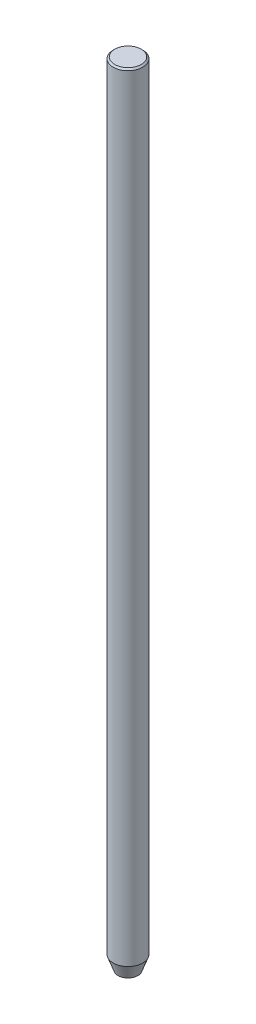
ISO-10303-21;
HEADER;
FILE_DESCRIPTION(('STEP AP214'),'2;1');
FILE_NAME('part.step','',(''),(''),'','','');
FILE_SCHEMA(('AUTOMOTIVE_DESIGN { 1 0 10303 214 1 1 1 1 }'));
ENDSEC;
DATA;
#1=APPLICATION_CONTEXT('core data for automotive mechanical design processes');
#2=APPLICATION_PROTOCOL_DEFINITION('international standard','automotive_design',2000,#1);
#3=PRODUCT_CONTEXT('',#1,'mechanical');
#4=PRODUCT('Part','Part','',(#3));
#5=PRODUCT_RELATED_PRODUCT_CATEGORY('part','',(#4));
#6=PRODUCT_DEFINITION_FORMATION('','',#4);
#7=PRODUCT_DEFINITION_CONTEXT('part definition',#1,'design');
#8=PRODUCT_DEFINITION('design','',#6,#7);
#9=PRODUCT_DEFINITION_SHAPE('','',#8);
#10=(LENGTH_UNIT() NAMED_UNIT(*) SI_UNIT(.MILLI.,.METRE.));
#11=(NAMED_UNIT(*) PLANE_ANGLE_UNIT() SI_UNIT($,.RADIAN.));
#12=(NAMED_UNIT(*) SI_UNIT($,.STERADIAN.) SOLID_ANGLE_UNIT());
#13=UNCERTAINTY_MEASURE_WITH_UNIT(LENGTH_MEASURE(1.E-05),#10,'distance_accuracy_value','');
#14=(GEOMETRIC_REPRESENTATION_CONTEXT(3) GLOBAL_UNCERTAINTY_ASSIGNED_CONTEXT((#13)) GLOBAL_UNIT_ASSIGNED_CONTEXT((#10,
#11,#12)) REPRESENTATION_CONTEXT('',''));
#15=CARTESIAN_POINT('',(0.,0.,0.));
#16=DIRECTION('',(0.,0.,1.));
#17=DIRECTION('',(1.,0.,0.));
#18=AXIS2_PLACEMENT_3D('',#15,#16,#17);
#19=CARTESIAN_POINT('',(0.,127.,0.));
#20=DIRECTION('',(0.,-1.,0.));
#21=DIRECTION('',(0.,0.,-1.));
#22=AXIS2_PLACEMENT_3D('',#19,#20,#21);
#23=CYLINDRICAL_SURFACE('',#22,2.38125);
#24=CARTESIAN_POINT('',(0.,2.1464667339489,0.));
#25=DIRECTION('',(0.,1.,0.));
#26=DIRECTION('',(0.,0.,1.));
#27=AXIS2_PLACEMENT_3D('',#24,#25,#26);
#28=CIRCLE('',#27,2.38125);
#29=CARTESIAN_POINT('',(0.,2.1464667339489,2.38125));
#30=VERTEX_POINT('',#29);
#31=EDGE_CURVE('E40',#30,#30,#28,.T.);
#32=ORIENTED_EDGE('',*,*,#31,.T.);
#33=EDGE_LOOP('',(#32));
#34=FACE_BOUND('',#33,.T.);
#35=CARTESIAN_POINT('',(0.,126.75,0.));
#36=DIRECTION('',(0.,1.,0.));
#37=DIRECTION('',(0.,0.,1.));
#38=AXIS2_PLACEMENT_3D('',#35,#36,#37);
#39=CIRCLE('',#38,2.38125);
#40=CARTESIAN_POINT('',(0.,126.75,2.38125));
#41=VERTEX_POINT('',#40);
#42=EDGE_CURVE('E36',#41,#41,#39,.F.);
#43=ORIENTED_EDGE('',*,*,#42,.T.);
#44=EDGE_LOOP('',(#43));
#45=FACE_BOUND('',#44,.T.);
#46=ADVANCED_FACE('F29',(#34,#45),#23,.T.);
#47=CARTESIAN_POINT('',(0.,127.,0.));
#48=DIRECTION('',(0.,1.,0.));
#49=DIRECTION('',(0.,0.,1.));
#50=AXIS2_PLACEMENT_3D('',#47,#48,#49);
#51=PLANE('',#50);
#52=CARTESIAN_POINT('',(0.,127.,0.));
#53=DIRECTION('',(0.,1.,0.));
#54=DIRECTION('',(0.,0.,1.));
#55=AXIS2_PLACEMENT_3D('',#52,#53,#54);
#56=CIRCLE('',#55,2.13124999999999);
#57=CARTESIAN_POINT('',(0.,127.,2.13124999999999));
#58=VERTEX_POINT('',#57);
#59=EDGE_CURVE('E10',#58,#58,#56,.T.);
#60=ORIENTED_EDGE('',*,*,#59,.T.);
#61=EDGE_LOOP('',(#60));
#62=FACE_BOUND('',#61,.T.);
#63=ADVANCED_FACE('F59',(#62),#51,.T.);
#64=CARTESIAN_POINT('',(0.,127.,0.));
#65=DIRECTION('',(0.,-1.,0.));
#66=DIRECTION('',(0.,0.,-1.));
#67=AXIS2_PLACEMENT_3D('',#64,#65,#66);
#68=CONICAL_SURFACE('',#67,2.13124999999999,0.785398163397473);
#69=ORIENTED_EDGE('',*,*,#42,.F.);
#70=EDGE_LOOP('',(#69));
#71=FACE_BOUND('',#70,.T.);
#72=ORIENTED_EDGE('',*,*,#59,.F.);
#73=EDGE_LOOP('',(#72));
#74=FACE_BOUND('',#73,.T.);
#75=ADVANCED_FACE('F31',(#71,#74),#68,.T.);
#76=CARTESIAN_POINT('',(0.,2.74747741945459,0.));
#77=DIRECTION('',(0.,1.,0.));
#78=DIRECTION('',(0.,0.,1.));
#79=AXIS2_PLACEMENT_3D('',#76,#77,#78);
#80=CONICAL_SURFACE('',#79,2.6,0.34906585039887);
#81=CARTESIAN_POINT('',(0.,0.,0.));
#82=DIRECTION('',(0.,-1.,0.));
#83=DIRECTION('',(0.,0.,-1.));
#84=AXIS2_PLACEMENT_3D('',#81,#82,#83);
#85=CIRCLE('',#84,1.6);
#86=CARTESIAN_POINT('',(0.,0.,-1.6));
#87=VERTEX_POINT('',#86);
#88=EDGE_CURVE('E44',#87,#87,#85,.T.);
#89=ORIENTED_EDGE('',*,*,#88,.F.);
#90=EDGE_LOOP('',(#89));
#91=FACE_BOUND('',#90,.T.);
#92=ORIENTED_EDGE('',*,*,#31,.F.);
#93=EDGE_LOOP('',(#92));
#94=FACE_BOUND('',#93,.T.);
#95=ADVANCED_FACE('F52',(#91,#94),#80,.T.);
#96=CARTESIAN_POINT('',(0.,0.,0.));
#97=DIRECTION('',(0.,1.,0.));
#98=DIRECTION('',(0.,0.,1.));
#99=AXIS2_PLACEMENT_3D('',#96,#97,#98);
#100=PLANE('',#99);
#101=ORIENTED_EDGE('',*,*,#88,.T.);
#102=EDGE_LOOP('',(#101));
#103=FACE_BOUND('',#102,.T.);
#104=ADVANCED_FACE('F50',(#103),#100,.F.);
#105=CLOSED_SHELL('',(#46,#63,#75,#95,#104));
#106=MANIFOLD_SOLID_BREP('B2',#105);
#107=ADVANCED_BREP_SHAPE_REPRESENTATION('',(#18,#106),#14);
#108=SHAPE_DEFINITION_REPRESENTATION(#9,#107);
ENDSEC;
END-ISO-10303-21;
